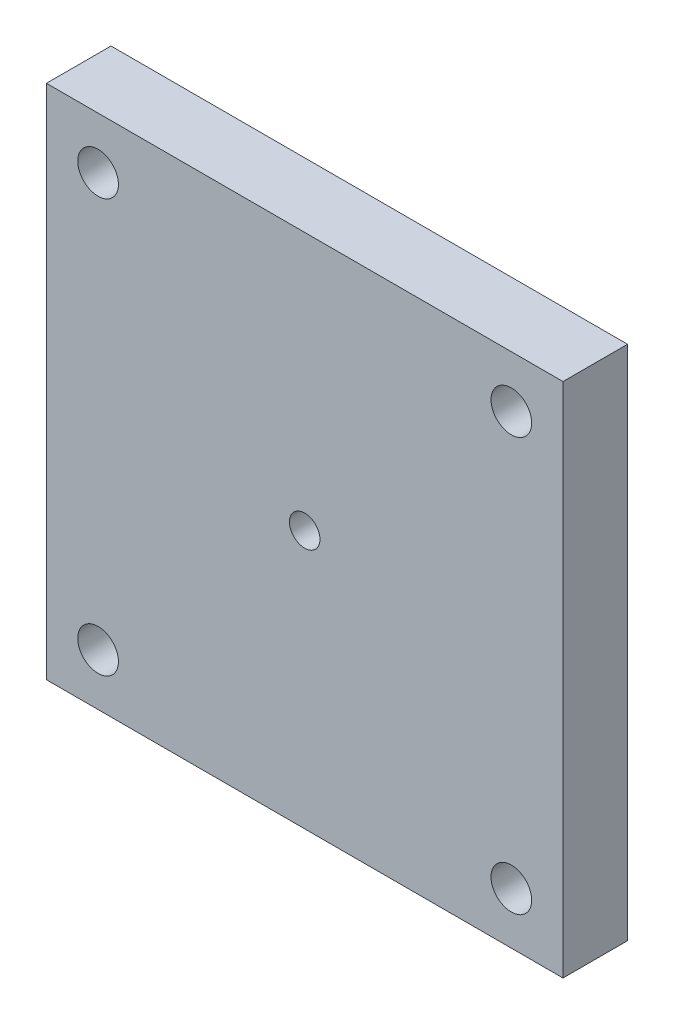
ISO-10303-21;
HEADER;
FILE_DESCRIPTION(('STEP AP214'),'2;1');
FILE_NAME('part.step','',(''),(''),'','','');
FILE_SCHEMA(('AUTOMOTIVE_DESIGN { 1 0 10303 214 1 1 1 1 }'));
ENDSEC;
DATA;
#1=APPLICATION_CONTEXT('core data for automotive mechanical design processes');
#2=APPLICATION_PROTOCOL_DEFINITION('international standard','automotive_design',2000,#1);
#3=PRODUCT_CONTEXT('',#1,'mechanical');
#4=PRODUCT('Part','Part','',(#3));
#5=PRODUCT_RELATED_PRODUCT_CATEGORY('part','',(#4));
#6=PRODUCT_DEFINITION_FORMATION('','',#4);
#7=PRODUCT_DEFINITION_CONTEXT('part definition',#1,'design');
#8=PRODUCT_DEFINITION('design','',#6,#7);
#9=PRODUCT_DEFINITION_SHAPE('','',#8);
#10=(LENGTH_UNIT() NAMED_UNIT(*) SI_UNIT(.MILLI.,.METRE.));
#11=(NAMED_UNIT(*) PLANE_ANGLE_UNIT() SI_UNIT($,.RADIAN.));
#12=(NAMED_UNIT(*) SI_UNIT($,.STERADIAN.) SOLID_ANGLE_UNIT());
#13=UNCERTAINTY_MEASURE_WITH_UNIT(LENGTH_MEASURE(1.E-05),#10,'distance_accuracy_value','');
#14=(GEOMETRIC_REPRESENTATION_CONTEXT(3) GLOBAL_UNCERTAINTY_ASSIGNED_CONTEXT((#13)) GLOBAL_UNIT_ASSIGNED_CONTEXT((#10,
#11,#12)) REPRESENTATION_CONTEXT('',''));
#15=CARTESIAN_POINT('',(0.,0.,0.));
#16=DIRECTION('',(0.,0.,1.));
#17=DIRECTION('',(1.,0.,0.));
#18=AXIS2_PLACEMENT_3D('',#15,#16,#17);
#19=CARTESIAN_POINT('',(0.,50.8,6.35));
#20=DIRECTION('',(0.,0.,-1.));
#21=DIRECTION('',(-1.,0.,0.));
#22=AXIS2_PLACEMENT_3D('',#19,#20,#21);
#23=PLANE('',#22);
#24=CARTESIAN_POINT('',(5.08,5.08,6.35));
#25=DIRECTION('',(0.,0.,1.));
#26=DIRECTION('',(1.,0.,0.));
#27=AXIS2_PLACEMENT_3D('',#24,#25,#26);
#28=CIRCLE('',#27,2.);
#29=CARTESIAN_POINT('',(7.08,5.08,6.35));
#30=VERTEX_POINT('',#29);
#31=EDGE_CURVE('E125',#30,#30,#28,.T.);
#32=ORIENTED_EDGE('',*,*,#31,.F.);
#33=EDGE_LOOP('',(#32));
#34=FACE_BOUND('',#33,.T.);
#35=CARTESIAN_POINT('',(45.72,45.72,6.35));
#36=DIRECTION('',(0.,0.,1.));
#37=DIRECTION('',(1.,0.,0.));
#38=AXIS2_PLACEMENT_3D('',#35,#36,#37);
#39=CIRCLE('',#38,2.);
#40=CARTESIAN_POINT('',(47.72,45.72,6.35));
#41=VERTEX_POINT('',#40);
#42=EDGE_CURVE('E113',#41,#41,#39,.T.);
#43=ORIENTED_EDGE('',*,*,#42,.F.);
#44=EDGE_LOOP('',(#43));
#45=FACE_BOUND('',#44,.T.);
#46=DIRECTION('',(0.,-1.,0.));
#47=VECTOR('',#46,1.);
#48=CARTESIAN_POINT('',(0.,0.,6.35));
#49=LINE('',#48,#47);
#50=CARTESIAN_POINT('',(0.,50.8,6.35));
#51=VERTEX_POINT('',#50);
#52=CARTESIAN_POINT('',(0.,0.,6.35));
#53=VERTEX_POINT('',#52);
#54=EDGE_CURVE('E83',#51,#53,#49,.T.);
#55=ORIENTED_EDGE('',*,*,#54,.T.);
#56=DIRECTION('',(1.,0.,0.));
#57=VECTOR('',#56,1.);
#58=CARTESIAN_POINT('',(0.,0.,6.35));
#59=LINE('',#58,#57);
#60=CARTESIAN_POINT('',(50.8,0.,6.35));
#61=VERTEX_POINT('',#60);
#62=EDGE_CURVE('E78',#53,#61,#59,.T.);
#63=ORIENTED_EDGE('',*,*,#62,.T.);
#64=DIRECTION('',(0.,1.,0.));
#65=VECTOR('',#64,1.);
#66=CARTESIAN_POINT('',(50.8,0.,6.35));
#67=LINE('',#66,#65);
#68=CARTESIAN_POINT('',(50.8,50.8,6.35));
#69=VERTEX_POINT('',#68);
#70=EDGE_CURVE('E81',#61,#69,#67,.T.);
#71=ORIENTED_EDGE('',*,*,#70,.T.);
#72=DIRECTION('',(-1.,0.,0.));
#73=VECTOR('',#72,1.);
#74=CARTESIAN_POINT('',(0.,50.8,6.35));
#75=LINE('',#74,#73);
#76=EDGE_CURVE('E48',#69,#51,#75,.T.);
#77=ORIENTED_EDGE('',*,*,#76,.T.);
#78=EDGE_LOOP('',(#55,#63,#71,#77));
#79=FACE_BOUND('',#78,.T.);
#80=CARTESIAN_POINT('',(5.08,45.72,6.35));
#81=DIRECTION('',(0.,0.,1.));
#82=DIRECTION('',(1.,0.,0.));
#83=AXIS2_PLACEMENT_3D('',#80,#81,#82);
#84=CIRCLE('',#83,2.);
#85=CARTESIAN_POINT('',(7.08,45.72,6.35));
#86=VERTEX_POINT('',#85);
#87=EDGE_CURVE('E98',#86,#86,#84,.T.);
#88=ORIENTED_EDGE('',*,*,#87,.F.);
#89=EDGE_LOOP('',(#88));
#90=FACE_BOUND('',#89,.T.);
#91=CARTESIAN_POINT('',(45.72,5.08,6.35));
#92=DIRECTION('',(0.,0.,1.));
#93=DIRECTION('',(1.,0.,0.));
#94=AXIS2_PLACEMENT_3D('',#91,#92,#93);
#95=CIRCLE('',#94,2.);
#96=CARTESIAN_POINT('',(47.72,5.08,6.35));
#97=VERTEX_POINT('',#96);
#98=EDGE_CURVE('E119',#97,#97,#95,.T.);
#99=ORIENTED_EDGE('',*,*,#98,.F.);
#100=EDGE_LOOP('',(#99));
#101=FACE_BOUND('',#100,.T.);
#102=CARTESIAN_POINT('',(25.4,25.4,6.35));
#103=DIRECTION('',(0.,0.,1.));
#104=DIRECTION('',(1.,0.,0.));
#105=AXIS2_PLACEMENT_3D('',#102,#103,#104);
#106=CIRCLE('',#105,1.4986);
#107=CARTESIAN_POINT('',(26.8986,25.4,6.35));
#108=VERTEX_POINT('',#107);
#109=EDGE_CURVE('E131',#108,#108,#106,.T.);
#110=ORIENTED_EDGE('',*,*,#109,.F.);
#111=EDGE_LOOP('',(#110));
#112=FACE_BOUND('',#111,.T.);
#113=ADVANCED_FACE('F31',(#34,#45,#79,#90,#101,#112),#23,.F.);
#114=CARTESIAN_POINT('',(0.,50.8,0.));
#115=DIRECTION('',(0.,0.,-1.));
#116=DIRECTION('',(-1.,0.,0.));
#117=AXIS2_PLACEMENT_3D('',#114,#115,#116);
#118=PLANE('',#117);
#119=CARTESIAN_POINT('',(5.08,5.08,0.));
#120=DIRECTION('',(0.,0.,1.));
#121=DIRECTION('',(1.,0.,0.));
#122=AXIS2_PLACEMENT_3D('',#119,#120,#121);
#123=CIRCLE('',#122,2.);
#124=CARTESIAN_POINT('',(7.08,5.08,0.));
#125=VERTEX_POINT('',#124);
#126=EDGE_CURVE('E128',#125,#125,#123,.T.);
#127=ORIENTED_EDGE('',*,*,#126,.T.);
#128=EDGE_LOOP('',(#127));
#129=FACE_BOUND('',#128,.T.);
#130=CARTESIAN_POINT('',(45.72,45.72,0.));
#131=DIRECTION('',(0.,0.,1.));
#132=DIRECTION('',(1.,0.,0.));
#133=AXIS2_PLACEMENT_3D('',#130,#131,#132);
#134=CIRCLE('',#133,2.);
#135=CARTESIAN_POINT('',(47.72,45.72,0.));
#136=VERTEX_POINT('',#135);
#137=EDGE_CURVE('E116',#136,#136,#134,.T.);
#138=ORIENTED_EDGE('',*,*,#137,.T.);
#139=EDGE_LOOP('',(#138));
#140=FACE_BOUND('',#139,.T.);
#141=DIRECTION('',(0.,-1.,0.));
#142=VECTOR('',#141,1.);
#143=CARTESIAN_POINT('',(0.,0.,0.));
#144=LINE('',#143,#142);
#145=CARTESIAN_POINT('',(0.,50.8,0.));
#146=VERTEX_POINT('',#145);
#147=CARTESIAN_POINT('',(0.,0.,0.));
#148=VERTEX_POINT('',#147);
#149=EDGE_CURVE('E95',#146,#148,#144,.T.);
#150=ORIENTED_EDGE('',*,*,#149,.F.);
#151=DIRECTION('',(-1.,0.,0.));
#152=VECTOR('',#151,1.);
#153=CARTESIAN_POINT('',(0.,50.8,0.));
#154=LINE('',#153,#152);
#155=CARTESIAN_POINT('',(50.8,50.8,0.));
#156=VERTEX_POINT('',#155);
#157=EDGE_CURVE('E71',#156,#146,#154,.T.);
#158=ORIENTED_EDGE('',*,*,#157,.F.);
#159=DIRECTION('',(0.,1.,0.));
#160=VECTOR('',#159,1.);
#161=CARTESIAN_POINT('',(50.8,0.,0.));
#162=LINE('',#161,#160);
#163=CARTESIAN_POINT('',(50.8,0.,0.));
#164=VERTEX_POINT('',#163);
#165=EDGE_CURVE('E65',#164,#156,#162,.T.);
#166=ORIENTED_EDGE('',*,*,#165,.F.);
#167=DIRECTION('',(1.,0.,0.));
#168=VECTOR('',#167,1.);
#169=CARTESIAN_POINT('',(0.,0.,0.));
#170=LINE('',#169,#168);
#171=EDGE_CURVE('E87',#148,#164,#170,.T.);
#172=ORIENTED_EDGE('',*,*,#171,.F.);
#173=EDGE_LOOP('',(#150,#158,#166,#172));
#174=FACE_BOUND('',#173,.T.);
#175=CARTESIAN_POINT('',(5.08,45.72,0.));
#176=DIRECTION('',(0.,0.,1.));
#177=DIRECTION('',(1.,0.,0.));
#178=AXIS2_PLACEMENT_3D('',#175,#176,#177);
#179=CIRCLE('',#178,2.);
#180=CARTESIAN_POINT('',(7.08,45.72,0.));
#181=VERTEX_POINT('',#180);
#182=EDGE_CURVE('E110',#181,#181,#179,.T.);
#183=ORIENTED_EDGE('',*,*,#182,.T.);
#184=EDGE_LOOP('',(#183));
#185=FACE_BOUND('',#184,.T.);
#186=CARTESIAN_POINT('',(45.72,5.08,0.));
#187=DIRECTION('',(0.,0.,1.));
#188=DIRECTION('',(1.,0.,0.));
#189=AXIS2_PLACEMENT_3D('',#186,#187,#188);
#190=CIRCLE('',#189,2.);
#191=CARTESIAN_POINT('',(47.72,5.08,0.));
#192=VERTEX_POINT('',#191);
#193=EDGE_CURVE('E122',#192,#192,#190,.T.);
#194=ORIENTED_EDGE('',*,*,#193,.T.);
#195=EDGE_LOOP('',(#194));
#196=FACE_BOUND('',#195,.T.);
#197=CARTESIAN_POINT('',(25.4,25.4,0.));
#198=DIRECTION('',(0.,0.,1.));
#199=DIRECTION('',(1.,0.,0.));
#200=AXIS2_PLACEMENT_3D('',#197,#198,#199);
#201=CIRCLE('',#200,1.4986);
#202=CARTESIAN_POINT('',(26.8986,25.4,0.));
#203=VERTEX_POINT('',#202);
#204=EDGE_CURVE('E134',#203,#203,#201,.T.);
#205=ORIENTED_EDGE('',*,*,#204,.T.);
#206=EDGE_LOOP('',(#205));
#207=FACE_BOUND('',#206,.T.);
#208=ADVANCED_FACE('F106',(#129,#140,#174,#185,#196,#207),#118,.T.);
#209=CARTESIAN_POINT('',(0.,0.,6.35));
#210=DIRECTION('',(1.,0.,0.));
#211=DIRECTION('',(0.,1.,0.));
#212=AXIS2_PLACEMENT_3D('',#209,#210,#211);
#213=PLANE('',#212);
#214=ORIENTED_EDGE('',*,*,#149,.T.);
#215=DIRECTION('',(0.,0.,-1.));
#216=VECTOR('',#215,1.);
#217=CARTESIAN_POINT('',(0.,0.,6.35));
#218=LINE('',#217,#216);
#219=EDGE_CURVE('E11',#53,#148,#218,.T.);
#220=ORIENTED_EDGE('',*,*,#219,.F.);
#221=ORIENTED_EDGE('',*,*,#54,.F.);
#222=DIRECTION('',(0.,0.,-1.));
#223=VECTOR('',#222,1.);
#224=CARTESIAN_POINT('',(0.,50.8,6.35));
#225=LINE('',#224,#223);
#226=EDGE_CURVE('E91',#51,#146,#225,.T.);
#227=ORIENTED_EDGE('',*,*,#226,.T.);
#228=EDGE_LOOP('',(#214,#220,#221,#227));
#229=FACE_BOUND('',#228,.T.);
#230=ADVANCED_FACE('F33',(#229),#213,.F.);
#231=CARTESIAN_POINT('',(0.,0.,6.35));
#232=DIRECTION('',(0.,1.,0.));
#233=DIRECTION('',(0.,0.,1.));
#234=AXIS2_PLACEMENT_3D('',#231,#232,#233);
#235=PLANE('',#234);
#236=ORIENTED_EDGE('',*,*,#171,.T.);
#237=DIRECTION('',(0.,0.,-1.));
#238=VECTOR('',#237,1.);
#239=CARTESIAN_POINT('',(50.8,0.,6.35));
#240=LINE('',#239,#238);
#241=EDGE_CURVE('E40',#61,#164,#240,.T.);
#242=ORIENTED_EDGE('',*,*,#241,.F.);
#243=ORIENTED_EDGE('',*,*,#62,.F.);
#244=ORIENTED_EDGE('',*,*,#219,.T.);
#245=EDGE_LOOP('',(#236,#242,#243,#244));
#246=FACE_BOUND('',#245,.T.);
#247=ADVANCED_FACE('F86',(#246),#235,.F.);
#248=CARTESIAN_POINT('',(50.8,0.,6.35));
#249=DIRECTION('',(-1.,0.,0.));
#250=DIRECTION('',(0.,-1.,0.));
#251=AXIS2_PLACEMENT_3D('',#248,#249,#250);
#252=PLANE('',#251);
#253=ORIENTED_EDGE('',*,*,#165,.T.);
#254=DIRECTION('',(0.,0.,-1.));
#255=VECTOR('',#254,1.);
#256=CARTESIAN_POINT('',(50.8,50.8,6.35));
#257=LINE('',#256,#255);
#258=EDGE_CURVE('E88',#69,#156,#257,.T.);
#259=ORIENTED_EDGE('',*,*,#258,.F.);
#260=ORIENTED_EDGE('',*,*,#70,.F.);
#261=ORIENTED_EDGE('',*,*,#241,.T.);
#262=EDGE_LOOP('',(#253,#259,#260,#261));
#263=FACE_BOUND('',#262,.T.);
#264=ADVANCED_FACE('F89',(#263),#252,.F.);
#265=CARTESIAN_POINT('',(0.,50.8,6.35));
#266=DIRECTION('',(0.,-1.,0.));
#267=DIRECTION('',(0.,0.,-1.));
#268=AXIS2_PLACEMENT_3D('',#265,#266,#267);
#269=PLANE('',#268);
#270=ORIENTED_EDGE('',*,*,#157,.T.);
#271=ORIENTED_EDGE('',*,*,#226,.F.);
#272=ORIENTED_EDGE('',*,*,#76,.F.);
#273=ORIENTED_EDGE('',*,*,#258,.T.);
#274=EDGE_LOOP('',(#270,#271,#272,#273));
#275=FACE_BOUND('',#274,.T.);
#276=ADVANCED_FACE('F103',(#275),#269,.F.);
#277=CARTESIAN_POINT('',(5.08,45.72,6.35));
#278=DIRECTION('',(0.,0.,-1.));
#279=DIRECTION('',(-1.,0.,0.));
#280=AXIS2_PLACEMENT_3D('',#277,#278,#279);
#281=CYLINDRICAL_SURFACE('',#280,2.);
#282=ORIENTED_EDGE('',*,*,#87,.T.);
#283=EDGE_LOOP('',(#282));
#284=FACE_BOUND('',#283,.T.);
#285=ORIENTED_EDGE('',*,*,#182,.F.);
#286=EDGE_LOOP('',(#285));
#287=FACE_BOUND('',#286,.T.);
#288=ADVANCED_FACE('F154',(#284,#287),#281,.F.);
#289=CARTESIAN_POINT('',(45.72,45.72,6.35));
#290=DIRECTION('',(0.,0.,-1.));
#291=DIRECTION('',(-1.,0.,0.));
#292=AXIS2_PLACEMENT_3D('',#289,#290,#291);
#293=CYLINDRICAL_SURFACE('',#292,2.);
#294=ORIENTED_EDGE('',*,*,#42,.T.);
#295=EDGE_LOOP('',(#294));
#296=FACE_BOUND('',#295,.T.);
#297=ORIENTED_EDGE('',*,*,#137,.F.);
#298=EDGE_LOOP('',(#297));
#299=FACE_BOUND('',#298,.T.);
#300=ADVANCED_FACE('F200',(#296,#299),#293,.F.);
#301=CARTESIAN_POINT('',(45.72,5.08,6.35));
#302=DIRECTION('',(0.,0.,-1.));
#303=DIRECTION('',(-1.,0.,0.));
#304=AXIS2_PLACEMENT_3D('',#301,#302,#303);
#305=CYLINDRICAL_SURFACE('',#304,2.);
#306=ORIENTED_EDGE('',*,*,#98,.T.);
#307=EDGE_LOOP('',(#306));
#308=FACE_BOUND('',#307,.T.);
#309=ORIENTED_EDGE('',*,*,#193,.F.);
#310=EDGE_LOOP('',(#309));
#311=FACE_BOUND('',#310,.T.);
#312=ADVANCED_FACE('F208',(#308,#311),#305,.F.);
#313=CARTESIAN_POINT('',(5.08,5.08,6.35));
#314=DIRECTION('',(0.,0.,-1.));
#315=DIRECTION('',(-1.,0.,0.));
#316=AXIS2_PLACEMENT_3D('',#313,#314,#315);
#317=CYLINDRICAL_SURFACE('',#316,2.);
#318=ORIENTED_EDGE('',*,*,#31,.T.);
#319=EDGE_LOOP('',(#318));
#320=FACE_BOUND('',#319,.T.);
#321=ORIENTED_EDGE('',*,*,#126,.F.);
#322=EDGE_LOOP('',(#321));
#323=FACE_BOUND('',#322,.T.);
#324=ADVANCED_FACE('F216',(#320,#323),#317,.F.);
#325=CARTESIAN_POINT('',(25.4,25.4,6.35));
#326=DIRECTION('',(0.,0.,-1.));
#327=DIRECTION('',(-1.,0.,0.));
#328=AXIS2_PLACEMENT_3D('',#325,#326,#327);
#329=CYLINDRICAL_SURFACE('',#328,1.4986);
#330=ORIENTED_EDGE('',*,*,#109,.T.);
#331=EDGE_LOOP('',(#330));
#332=FACE_BOUND('',#331,.T.);
#333=ORIENTED_EDGE('',*,*,#204,.F.);
#334=EDGE_LOOP('',(#333));
#335=FACE_BOUND('',#334,.T.);
#336=ADVANCED_FACE('F140',(#332,#335),#329,.F.);
#337=CLOSED_SHELL('',(#113,#208,#230,#247,#264,#276,#288,#300,#312,#324,#336));
#338=MANIFOLD_SOLID_BREP('B2',#337);
#339=ADVANCED_BREP_SHAPE_REPRESENTATION('',(#18,#338),#14);
#340=SHAPE_DEFINITION_REPRESENTATION(#9,#339);
ENDSEC;
END-ISO-10303-21;
